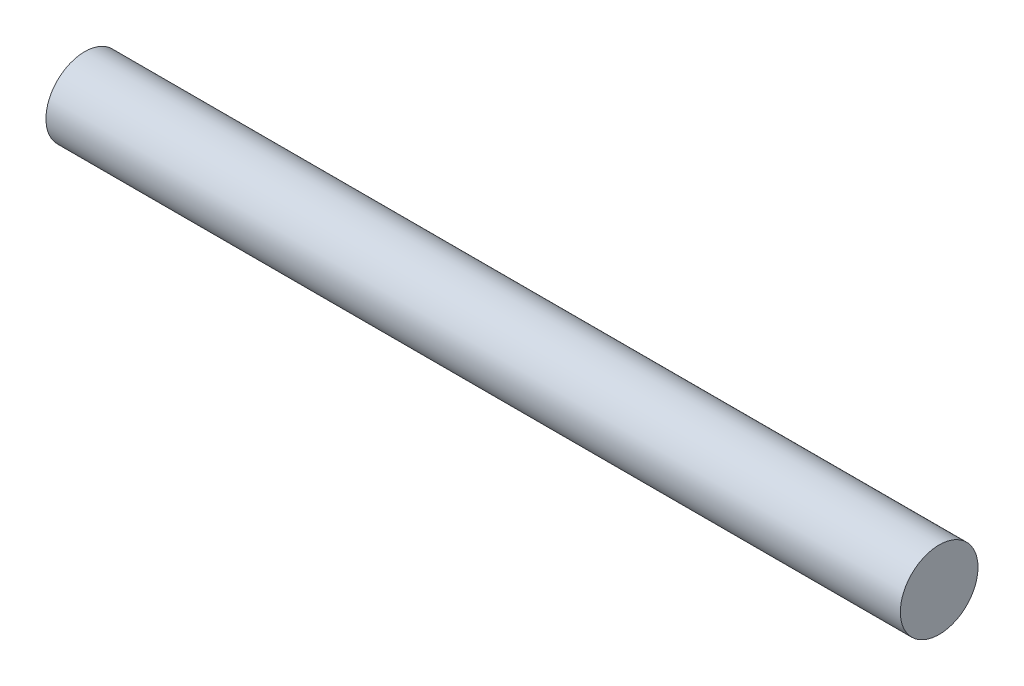
ISO-10303-21;
HEADER;
FILE_DESCRIPTION(('STEP AP214'),'2;1');
FILE_NAME('part.step','',(''),(''),'','','');
FILE_SCHEMA(('AUTOMOTIVE_DESIGN { 1 0 10303 214 1 1 1 1 }'));
ENDSEC;
DATA;
#1=APPLICATION_CONTEXT('core data for automotive mechanical design processes');
#2=APPLICATION_PROTOCOL_DEFINITION('international standard','automotive_design',2000,#1);
#3=PRODUCT_CONTEXT('',#1,'mechanical');
#4=PRODUCT('Part','Part','',(#3));
#5=PRODUCT_RELATED_PRODUCT_CATEGORY('part','',(#4));
#6=PRODUCT_DEFINITION_FORMATION('','',#4);
#7=PRODUCT_DEFINITION_CONTEXT('part definition',#1,'design');
#8=PRODUCT_DEFINITION('design','',#6,#7);
#9=PRODUCT_DEFINITION_SHAPE('','',#8);
#10=(LENGTH_UNIT() NAMED_UNIT(*) SI_UNIT(.MILLI.,.METRE.));
#11=(NAMED_UNIT(*) PLANE_ANGLE_UNIT() SI_UNIT($,.RADIAN.));
#12=(NAMED_UNIT(*) SI_UNIT($,.STERADIAN.) SOLID_ANGLE_UNIT());
#13=UNCERTAINTY_MEASURE_WITH_UNIT(LENGTH_MEASURE(1.E-05),#10,'distance_accuracy_value','');
#14=(GEOMETRIC_REPRESENTATION_CONTEXT(3) GLOBAL_UNCERTAINTY_ASSIGNED_CONTEXT((#13)) GLOBAL_UNIT_ASSIGNED_CONTEXT((#10,
#11,#12)) REPRESENTATION_CONTEXT('',''));
#15=CARTESIAN_POINT('',(0.,0.,0.));
#16=DIRECTION('',(0.,0.,1.));
#17=DIRECTION('',(1.,0.,0.));
#18=AXIS2_PLACEMENT_3D('',#15,#16,#17);
#19=CARTESIAN_POINT('',(27.5,0.,0.));
#20=DIRECTION('',(-1.,0.,0.));
#21=DIRECTION('',(0.,0.,1.));
#22=AXIS2_PLACEMENT_3D('',#19,#20,#21);
#23=CYLINDRICAL_SURFACE('',#22,2.5);
#24=CARTESIAN_POINT('',(27.5,0.,0.));
#25=DIRECTION('',(1.,0.,0.));
#26=DIRECTION('',(0.,0.,-1.));
#27=AXIS2_PLACEMENT_3D('',#24,#25,#26);
#28=CIRCLE('',#27,2.5);
#29=CARTESIAN_POINT('',(27.5,0.,-2.5));
#30=VERTEX_POINT('',#29);
#31=EDGE_CURVE('E10',#30,#30,#28,.T.);
#32=ORIENTED_EDGE('',*,*,#31,.F.);
#33=EDGE_LOOP('',(#32));
#34=FACE_BOUND('',#33,.T.);
#35=CARTESIAN_POINT('',(-27.5,0.,0.));
#36=DIRECTION('',(1.,0.,0.));
#37=DIRECTION('',(0.,0.,-1.));
#38=AXIS2_PLACEMENT_3D('',#35,#36,#37);
#39=CIRCLE('',#38,2.5);
#40=CARTESIAN_POINT('',(-27.5,0.,-2.5));
#41=VERTEX_POINT('',#40);
#42=EDGE_CURVE('E35',#41,#41,#39,.T.);
#43=ORIENTED_EDGE('',*,*,#42,.T.);
#44=EDGE_LOOP('',(#43));
#45=FACE_BOUND('',#44,.T.);
#46=ADVANCED_FACE('F32',(#34,#45),#23,.T.);
#47=CARTESIAN_POINT('',(27.5,0.,0.));
#48=DIRECTION('',(1.,0.,0.));
#49=DIRECTION('',(0.,0.,-1.));
#50=AXIS2_PLACEMENT_3D('',#47,#48,#49);
#51=PLANE('',#50);
#52=ORIENTED_EDGE('',*,*,#31,.T.);
#53=EDGE_LOOP('',(#52));
#54=FACE_BOUND('',#53,.T.);
#55=ADVANCED_FACE('F47',(#54),#51,.T.);
#56=CARTESIAN_POINT('',(-27.5,0.,0.));
#57=DIRECTION('',(1.,0.,0.));
#58=DIRECTION('',(0.,0.,-1.));
#59=AXIS2_PLACEMENT_3D('',#56,#57,#58);
#60=PLANE('',#59);
#61=ORIENTED_EDGE('',*,*,#42,.F.);
#62=EDGE_LOOP('',(#61));
#63=FACE_BOUND('',#62,.T.);
#64=ADVANCED_FACE('F45',(#63),#60,.F.);
#65=CLOSED_SHELL('',(#46,#55,#64));
#66=MANIFOLD_SOLID_BREP('B2',#65);
#67=ADVANCED_BREP_SHAPE_REPRESENTATION('',(#18,#66),#14);
#68=SHAPE_DEFINITION_REPRESENTATION(#9,#67);
ENDSEC;
END-ISO-10303-21;
